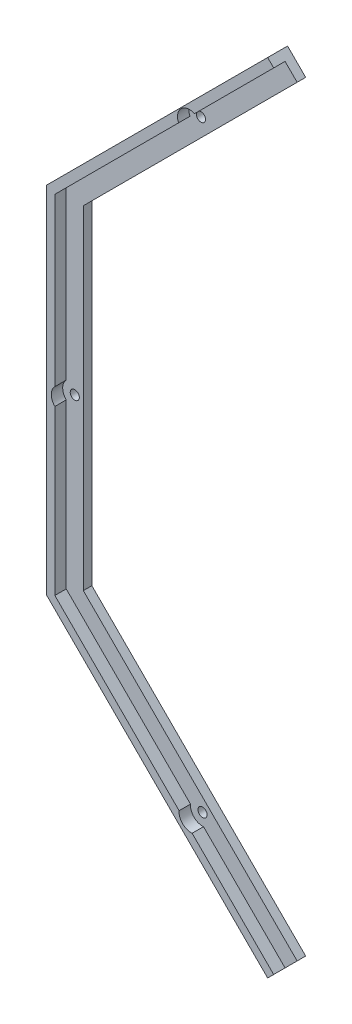
ISO-10303-21;
HEADER;
FILE_DESCRIPTION(('STEP AP214'),'2;1');
FILE_NAME('part.step','',(''),(''),'','','');
FILE_SCHEMA(('AUTOMOTIVE_DESIGN { 1 0 10303 214 1 1 1 1 }'));
ENDSEC;
DATA;
#1=APPLICATION_CONTEXT('core data for automotive mechanical design processes');
#2=APPLICATION_PROTOCOL_DEFINITION('international standard','automotive_design',2000,#1);
#3=PRODUCT_CONTEXT('',#1,'mechanical');
#4=PRODUCT('Part','Part','',(#3));
#5=PRODUCT_RELATED_PRODUCT_CATEGORY('part','',(#4));
#6=PRODUCT_DEFINITION_FORMATION('','',#4);
#7=PRODUCT_DEFINITION_CONTEXT('part definition',#1,'design');
#8=PRODUCT_DEFINITION('design','',#6,#7);
#9=PRODUCT_DEFINITION_SHAPE('','',#8);
#10=(LENGTH_UNIT() NAMED_UNIT(*) SI_UNIT(.MILLI.,.METRE.));
#11=(NAMED_UNIT(*) PLANE_ANGLE_UNIT() SI_UNIT($,.RADIAN.));
#12=(NAMED_UNIT(*) SI_UNIT($,.STERADIAN.) SOLID_ANGLE_UNIT());
#13=UNCERTAINTY_MEASURE_WITH_UNIT(LENGTH_MEASURE(1.E-05),#10,'distance_accuracy_value','');
#14=(GEOMETRIC_REPRESENTATION_CONTEXT(3) GLOBAL_UNCERTAINTY_ASSIGNED_CONTEXT((#13)) GLOBAL_UNIT_ASSIGNED_CONTEXT((#10,
#11,#12)) REPRESENTATION_CONTEXT('',''));
#15=CARTESIAN_POINT('',(0.,0.,0.));
#16=DIRECTION('',(0.,0.,1.));
#17=DIRECTION('',(1.,0.,0.));
#18=AXIS2_PLACEMENT_3D('',#15,#16,#17);
#19=CARTESIAN_POINT('',(-150.92388155424,61.0502525316989,10.));
#20=DIRECTION('',(-0.707106781186548,0.707106781186547,0.));
#21=DIRECTION('',(-0.707106781186547,-0.707106781186548,0.));
#22=AXIS2_PLACEMENT_3D('',#19,#20,#21);
#23=PLANE('',#22);
#24=DIRECTION('',(0.,0.,-1.));
#25=VECTOR('',#24,1.);
#26=CARTESIAN_POINT('',(-101.826733435737,110.147400650202,10.));
#27=LINE('',#26,#25);
#28=CARTESIAN_POINT('',(-101.826733435737,110.147400650202,6.));
#29=VERTEX_POINT('',#28);
#30=CARTESIAN_POINT('',(-101.826733435737,110.147400650202,10.));
#31=VERTEX_POINT('',#30);
#32=EDGE_CURVE('E60',#29,#31,#27,.F.);
#33=ORIENTED_EDGE('',*,*,#32,.F.);
#34=DIRECTION('',(0.707106781186547,0.707106781186548,0.));
#35=VECTOR('',#34,1.);
#36=CARTESIAN_POINT('',(-150.92388155424,61.0502525316989,6.));
#37=LINE('',#36,#35);
#38=CARTESIAN_POINT('',(-74.0208152801602,137.953318805779,6.));
#39=VERTEX_POINT('',#38);
#40=EDGE_CURVE('E11',#29,#39,#37,.T.);
#41=ORIENTED_EDGE('',*,*,#40,.T.);
#42=DIRECTION('',(0.,0.,-1.));
#43=VECTOR('',#42,1.);
#44=CARTESIAN_POINT('',(-74.0208152801602,137.953318805779,10.));
#45=LINE('',#44,#43);
#46=CARTESIAN_POINT('',(-74.0208152801602,137.953318805779,10.));
#47=VERTEX_POINT('',#46);
#48=EDGE_CURVE('E210',#47,#39,#45,.T.);
#49=ORIENTED_EDGE('',*,*,#48,.F.);
#50=DIRECTION('',(0.707106781186547,0.707106781186548,0.));
#51=VECTOR('',#50,1.);
#52=CARTESIAN_POINT('',(-150.92388155424,61.0502525316989,10.));
#53=LINE('',#52,#51);
#54=EDGE_CURVE('E202',#31,#47,#53,.T.);
#55=ORIENTED_EDGE('',*,*,#54,.F.);
#56=EDGE_LOOP('',(#33,#41,#49,#55));
#57=FACE_BOUND('',#56,.T.);
#58=ADVANCED_FACE('F35',(#57),#23,.F.);
#59=DIRECTION('',(0.,0.,-1.));
#60=VECTOR('',#59,1.);
#61=CARTESIAN_POINT('',(-107.450344375338,104.523789710601,10.));
#62=LINE('',#61,#60);
#63=CARTESIAN_POINT('',(-107.450344375338,104.523789710601,10.));
#64=VERTEX_POINT('',#63);
#65=CARTESIAN_POINT('',(-107.450344375338,104.523789710601,6.));
#66=VERTEX_POINT('',#65);
#67=EDGE_CURVE('E339',#64,#66,#62,.T.);
#68=ORIENTED_EDGE('',*,*,#67,.F.);
#69=CARTESIAN_POINT('',(-150.92388155424,61.0502525316989,10.));
#70=VERTEX_POINT('',#69);
#71=EDGE_CURVE('E325',#70,#64,#53,.T.);
#72=ORIENTED_EDGE('',*,*,#71,.F.);
#73=DIRECTION('',(0.,0.,-1.));
#74=VECTOR('',#73,1.);
#75=CARTESIAN_POINT('',(-150.92388155424,61.0502525316989,10.));
#76=LINE('',#75,#74);
#77=CARTESIAN_POINT('',(-150.92388155424,61.0502525316989,6.));
#78=VERTEX_POINT('',#77);
#79=EDGE_CURVE('E192',#70,#78,#76,.T.);
#80=ORIENTED_EDGE('',*,*,#79,.T.);
#81=EDGE_CURVE('E45',#78,#66,#37,.T.);
#82=ORIENTED_EDGE('',*,*,#81,.T.);
#83=EDGE_LOOP('',(#68,#72,#80,#82));
#84=FACE_BOUND('',#83,.T.);
#85=ADVANCED_FACE('F350',(#84),#23,.F.);
#86=CARTESIAN_POINT('',(-74.0208152801602,-137.953318805781,10.));
#87=DIRECTION('',(-0.707106781186547,-0.707106781186547,0.));
#88=DIRECTION('',(0.707106781186548,-0.707106781186548,0.));
#89=AXIS2_PLACEMENT_3D('',#86,#87,#88);
#90=PLANE('',#89);
#91=DIRECTION('',(0.,0.,-1.));
#92=VECTOR('',#91,1.);
#93=CARTESIAN_POINT('',(-107.263636264678,-104.710497821264,10.));
#94=LINE('',#93,#92);
#95=CARTESIAN_POINT('',(-107.263636264678,-104.710497821264,6.));
#96=VERTEX_POINT('',#95);
#97=CARTESIAN_POINT('',(-107.263636264678,-104.710497821264,10.));
#98=VERTEX_POINT('',#97);
#99=EDGE_CURVE('E52',#96,#98,#94,.F.);
#100=ORIENTED_EDGE('',*,*,#99,.F.);
#101=DIRECTION('',(-0.707106781186547,0.707106781186547,0.));
#102=VECTOR('',#101,1.);
#103=CARTESIAN_POINT('',(-74.0208152801602,-137.953318805781,6.));
#104=LINE('',#103,#102);
#105=CARTESIAN_POINT('',(-150.92388155424,-61.0502525317016,6.));
#106=VERTEX_POINT('',#105);
#107=EDGE_CURVE('E195',#96,#106,#104,.T.);
#108=ORIENTED_EDGE('',*,*,#107,.T.);
#109=DIRECTION('',(0.,0.,-1.));
#110=VECTOR('',#109,1.);
#111=CARTESIAN_POINT('',(-150.92388155424,-61.0502525317016,10.));
#112=LINE('',#111,#110);
#113=CARTESIAN_POINT('',(-150.92388155424,-61.0502525317016,10.));
#114=VERTEX_POINT('',#113);
#115=EDGE_CURVE('E205',#114,#106,#112,.T.);
#116=ORIENTED_EDGE('',*,*,#115,.F.);
#117=DIRECTION('',(-0.707106781186547,0.707106781186547,0.));
#118=VECTOR('',#117,1.);
#119=CARTESIAN_POINT('',(-74.0208152801602,-137.953318805781,10.));
#120=LINE('',#119,#118);
#121=EDGE_CURVE('E185',#98,#114,#120,.T.);
#122=ORIENTED_EDGE('',*,*,#121,.F.);
#123=EDGE_LOOP('',(#100,#108,#116,#122));
#124=FACE_BOUND('',#123,.T.);
#125=ADVANCED_FACE('F368',(#124),#90,.F.);
#126=DIRECTION('',(0.,0.,-1.));
#127=VECTOR('',#126,1.);
#128=CARTESIAN_POINT('',(-102.681060569722,-109.293073516219,10.));
#129=LINE('',#128,#127);
#130=CARTESIAN_POINT('',(-102.681060569722,-109.293073516219,10.));
#131=VERTEX_POINT('',#130);
#132=CARTESIAN_POINT('',(-102.681060569722,-109.293073516219,6.));
#133=VERTEX_POINT('',#132);
#134=EDGE_CURVE('E161',#131,#133,#129,.T.);
#135=ORIENTED_EDGE('',*,*,#134,.F.);
#136=CARTESIAN_POINT('',(-74.0208152801602,-137.953318805781,10.));
#137=VERTEX_POINT('',#136);
#138=EDGE_CURVE('E174',#137,#131,#120,.T.);
#139=ORIENTED_EDGE('',*,*,#138,.F.);
#140=DIRECTION('',(0.,0.,-1.));
#141=VECTOR('',#140,1.);
#142=CARTESIAN_POINT('',(-74.0208152801602,-137.953318805781,10.));
#143=LINE('',#142,#141);
#144=CARTESIAN_POINT('',(-74.0208152801602,-137.953318805781,6.));
#145=VERTEX_POINT('',#144);
#146=EDGE_CURVE('E208',#137,#145,#143,.T.);
#147=ORIENTED_EDGE('',*,*,#146,.T.);
#148=EDGE_CURVE('E175',#145,#133,#104,.T.);
#149=ORIENTED_EDGE('',*,*,#148,.T.);
#150=EDGE_LOOP('',(#135,#139,#147,#149));
#151=FACE_BOUND('',#150,.T.);
#152=ADVANCED_FACE('F172',(#151),#90,.F.);
#153=CARTESIAN_POINT('',(-150.92388155424,-61.0502525317016,10.));
#154=DIRECTION('',(-1.,0.,0.));
#155=DIRECTION('',(0.,0.,1.));
#156=AXIS2_PLACEMENT_3D('',#153,#154,#155);
#157=PLANE('',#156);
#158=DIRECTION('',(0.,0.,-1.));
#159=VECTOR('',#158,1.);
#160=CARTESIAN_POINT('',(-150.92388155424,2.51039864469681,10.));
#161=LINE('',#160,#159);
#162=CARTESIAN_POINT('',(-150.92388155424,2.51039864469681,6.));
#163=VERTEX_POINT('',#162);
#164=CARTESIAN_POINT('',(-150.92388155424,2.51039864469681,10.));
#165=VERTEX_POINT('',#164);
#166=EDGE_CURVE('E329',#163,#165,#161,.F.);
#167=ORIENTED_EDGE('',*,*,#166,.F.);
#168=DIRECTION('',(0.,1.,0.));
#169=VECTOR('',#168,1.);
#170=CARTESIAN_POINT('',(-150.92388155424,-61.0502525317016,6.));
#171=LINE('',#170,#169);
#172=EDGE_CURVE('E198',#163,#78,#171,.T.);
#173=ORIENTED_EDGE('',*,*,#172,.T.);
#174=ORIENTED_EDGE('',*,*,#79,.F.);
#175=DIRECTION('',(0.,1.,0.));
#176=VECTOR('',#175,1.);
#177=CARTESIAN_POINT('',(-150.92388155424,-61.0502525317016,10.));
#178=LINE('',#177,#176);
#179=EDGE_CURVE('E184',#165,#70,#178,.T.);
#180=ORIENTED_EDGE('',*,*,#179,.F.);
#181=EDGE_LOOP('',(#167,#173,#174,#180));
#182=FACE_BOUND('',#181,.T.);
#183=ADVANCED_FACE('F357',(#182),#157,.F.);
#184=DIRECTION('',(0.,0.,-1.));
#185=VECTOR('',#184,1.);
#186=CARTESIAN_POINT('',(-150.92388155424,-3.5103986446994,10.));
#187=LINE('',#186,#185);
#188=CARTESIAN_POINT('',(-150.92388155424,-3.5103986446994,10.));
#189=VERTEX_POINT('',#188);
#190=CARTESIAN_POINT('',(-150.92388155424,-3.5103986446994,6.));
#191=VERTEX_POINT('',#190);
#192=EDGE_CURVE('E331',#189,#191,#187,.T.);
#193=ORIENTED_EDGE('',*,*,#192,.F.);
#194=EDGE_CURVE('E187',#114,#189,#178,.T.);
#195=ORIENTED_EDGE('',*,*,#194,.F.);
#196=ORIENTED_EDGE('',*,*,#115,.T.);
#197=EDGE_CURVE('E199',#106,#191,#171,.T.);
#198=ORIENTED_EDGE('',*,*,#197,.T.);
#199=EDGE_LOOP('',(#193,#195,#196,#198));
#200=FACE_BOUND('',#199,.T.);
#201=ADVANCED_FACE('F373',(#200),#157,.F.);
#202=CARTESIAN_POINT('',(0.,0.,6.));
#203=DIRECTION('',(0.,0.,-1.));
#204=DIRECTION('',(-1.,0.,0.));
#205=AXIS2_PLACEMENT_3D('',#202,#203,#204);
#206=PLANE('',#205);
#207=ORIENTED_EDGE('',*,*,#40,.F.);
#208=CARTESIAN_POINT('',(-103.577878733758,106.274935008621,6.));
#209=DIRECTION('',(0.,0.,1.));
#210=DIRECTION('',(1.,0.,0.));
#211=AXIS2_PLACEMENT_3D('',#208,#209,#210);
#212=CIRCLE('',#211,4.25000000000001);
#213=EDGE_CURVE('E166',#29,#66,#212,.T.);
#214=ORIENTED_EDGE('',*,*,#213,.T.);
#215=ORIENTED_EDGE('',*,*,#81,.F.);
#216=ORIENTED_EDGE('',*,*,#172,.F.);
#217=CARTESIAN_POINT('',(-147.92388155424,-0.500000000001298,6.));
#218=DIRECTION('',(0.,0.,1.));
#219=DIRECTION('',(1.,0.,0.));
#220=AXIS2_PLACEMENT_3D('',#217,#218,#219);
#221=CIRCLE('',#220,4.25000000000001);
#222=EDGE_CURVE('E334',#163,#191,#221,.T.);
#223=ORIENTED_EDGE('',*,*,#222,.T.);
#224=ORIENTED_EDGE('',*,*,#197,.F.);
#225=ORIENTED_EDGE('',*,*,#107,.F.);
#226=CARTESIAN_POINT('',(-103.027804768937,-105.057242020478,6.));
#227=DIRECTION('',(0.,0.,1.));
#228=DIRECTION('',(1.,0.,0.));
#229=AXIS2_PLACEMENT_3D('',#226,#227,#228);
#230=CIRCLE('',#229,4.25000000000001);
#231=EDGE_CURVE('E167',#96,#133,#230,.T.);
#232=ORIENTED_EDGE('',*,*,#231,.T.);
#233=ORIENTED_EDGE('',*,*,#148,.F.);
#234=DIRECTION('',(0.707106781186546,0.707106781186549,0.));
#235=VECTOR('',#234,1.);
#236=CARTESIAN_POINT('',(-69.7781745930409,-133.710678118662,6.));
#237=LINE('',#236,#235);
#238=CARTESIAN_POINT('',(-69.7781745930409,-133.710678118662,6.));
#239=VERTEX_POINT('',#238);
#240=EDGE_CURVE('E229',#145,#239,#237,.T.);
#241=ORIENTED_EDGE('',*,*,#240,.T.);
#242=DIRECTION('',(-0.707106781186548,0.707106781186547,0.));
#243=VECTOR('',#242,1.);
#244=CARTESIAN_POINT('',(-144.92388155424,-58.564971157463,6.));
#245=LINE('',#244,#243);
#246=CARTESIAN_POINT('',(-144.92388155424,-58.564971157463,6.));
#247=VERTEX_POINT('',#246);
#248=EDGE_CURVE('E231',#239,#247,#245,.T.);
#249=ORIENTED_EDGE('',*,*,#248,.T.);
#250=DIRECTION('',(0.,1.,0.));
#251=VECTOR('',#250,1.);
#252=CARTESIAN_POINT('',(-144.92388155424,58.5649711574602,6.));
#253=LINE('',#252,#251);
#254=CARTESIAN_POINT('',(-144.92388155424,58.5649711574602,6.));
#255=VERTEX_POINT('',#254);
#256=EDGE_CURVE('E234',#247,#255,#253,.T.);
#257=ORIENTED_EDGE('',*,*,#256,.T.);
#258=DIRECTION('',(0.707106781186547,0.707106781186548,0.));
#259=VECTOR('',#258,1.);
#260=CARTESIAN_POINT('',(-69.7781745930409,133.71067811866,6.));
#261=LINE('',#260,#259);
#262=CARTESIAN_POINT('',(-69.7781745930409,133.71067811866,6.));
#263=VERTEX_POINT('',#262);
#264=EDGE_CURVE('E236',#255,#263,#261,.T.);
#265=ORIENTED_EDGE('',*,*,#264,.T.);
#266=DIRECTION('',(-0.707106781186548,0.707106781186547,0.));
#267=VECTOR('',#266,1.);
#268=CARTESIAN_POINT('',(-76.1421356237198,140.074639149338,6.));
#269=LINE('',#268,#267);
#270=EDGE_CURVE('E238',#263,#39,#269,.T.);
#271=ORIENTED_EDGE('',*,*,#270,.T.);
#272=EDGE_LOOP('',(#207,#214,#215,#216,#223,#224,#225,#232,#233,#241,#249,#257,#265,#271));
#273=FACE_BOUND('',#272,.T.);
#274=CARTESIAN_POINT('',(-147.92388155424,-0.500000000001298,6.));
#275=DIRECTION('',(0.,0.,1.));
#276=DIRECTION('',(1.,0.,0.));
#277=AXIS2_PLACEMENT_3D('',#274,#275,#276);
#278=CIRCLE('',#277,1.59999999999999);
#279=CARTESIAN_POINT('',(-146.32388155424,-0.500000000001298,6.));
#280=VERTEX_POINT('',#279);
#281=EDGE_CURVE('E223',#280,#280,#278,.T.);
#282=ORIENTED_EDGE('',*,*,#281,.F.);
#283=EDGE_LOOP('',(#282));
#284=FACE_BOUND('',#283,.T.);
#285=CARTESIAN_POINT('',(-103.027804768937,-105.057242020478,6.));
#286=DIRECTION('',(0.,0.,1.));
#287=DIRECTION('',(1.,0.,0.));
#288=AXIS2_PLACEMENT_3D('',#285,#286,#287);
#289=CIRCLE('',#288,1.60000000000001);
#290=CARTESIAN_POINT('',(-101.427804768937,-105.057242020478,6.));
#291=VERTEX_POINT('',#290);
#292=EDGE_CURVE('E220',#291,#291,#289,.T.);
#293=ORIENTED_EDGE('',*,*,#292,.F.);
#294=EDGE_LOOP('',(#293));
#295=FACE_BOUND('',#294,.T.);
#296=CARTESIAN_POINT('',(-103.577878733758,106.274935008621,6.));
#297=DIRECTION('',(0.,0.,1.));
#298=DIRECTION('',(1.,0.,0.));
#299=AXIS2_PLACEMENT_3D('',#296,#297,#298);
#300=CIRCLE('',#299,1.60000000000001);
#301=CARTESIAN_POINT('',(-101.977878733758,106.274935008621,6.));
#302=VERTEX_POINT('',#301);
#303=EDGE_CURVE('E214',#302,#302,#300,.T.);
#304=ORIENTED_EDGE('',*,*,#303,.F.);
#305=EDGE_LOOP('',(#304));
#306=FACE_BOUND('',#305,.T.);
#307=ADVANCED_FACE('F361',(#273,#284,#295,#306),#206,.F.);
#308=CARTESIAN_POINT('',(-103.577878733758,106.274935008621,6.));
#309=DIRECTION('',(0.,0.,-1.));
#310=DIRECTION('',(-1.,0.,0.));
#311=AXIS2_PLACEMENT_3D('',#308,#309,#310);
#312=CYLINDRICAL_SURFACE('',#311,1.60000000000001);
#313=ORIENTED_EDGE('',*,*,#303,.T.);
#314=EDGE_LOOP('',(#313));
#315=FACE_BOUND('',#314,.T.);
#316=CARTESIAN_POINT('',(-103.577878733758,106.274935008621,3.));
#317=DIRECTION('',(0.,0.,1.));
#318=DIRECTION('',(1.,0.,0.));
#319=AXIS2_PLACEMENT_3D('',#316,#317,#318);
#320=CIRCLE('',#319,1.60000000000001);
#321=CARTESIAN_POINT('',(-101.977878733758,106.274935008621,3.));
#322=VERTEX_POINT('',#321);
#323=EDGE_CURVE('E213',#322,#322,#320,.T.);
#324=ORIENTED_EDGE('',*,*,#323,.F.);
#325=EDGE_LOOP('',(#324));
#326=FACE_BOUND('',#325,.T.);
#327=ADVANCED_FACE('F394',(#315,#326),#312,.F.);
#328=CARTESIAN_POINT('',(-103.027804768937,-105.057242020478,6.));
#329=DIRECTION('',(0.,0.,-1.));
#330=DIRECTION('',(-1.,0.,0.));
#331=AXIS2_PLACEMENT_3D('',#328,#329,#330);
#332=CYLINDRICAL_SURFACE('',#331,1.60000000000001);
#333=ORIENTED_EDGE('',*,*,#292,.T.);
#334=EDGE_LOOP('',(#333));
#335=FACE_BOUND('',#334,.T.);
#336=CARTESIAN_POINT('',(-103.027804768937,-105.057242020478,3.));
#337=DIRECTION('',(0.,0.,1.));
#338=DIRECTION('',(1.,0.,0.));
#339=AXIS2_PLACEMENT_3D('',#336,#337,#338);
#340=CIRCLE('',#339,1.60000000000001);
#341=CARTESIAN_POINT('',(-101.427804768937,-105.057242020478,3.));
#342=VERTEX_POINT('',#341);
#343=EDGE_CURVE('E217',#342,#342,#340,.T.);
#344=ORIENTED_EDGE('',*,*,#343,.F.);
#345=EDGE_LOOP('',(#344));
#346=FACE_BOUND('',#345,.T.);
#347=ADVANCED_FACE('F397',(#335,#346),#332,.F.);
#348=CARTESIAN_POINT('',(-147.92388155424,-0.500000000001298,6.));
#349=DIRECTION('',(0.,0.,-1.));
#350=DIRECTION('',(-1.,0.,0.));
#351=AXIS2_PLACEMENT_3D('',#348,#349,#350);
#352=CYLINDRICAL_SURFACE('',#351,1.59999999999999);
#353=ORIENTED_EDGE('',*,*,#281,.T.);
#354=EDGE_LOOP('',(#353));
#355=FACE_BOUND('',#354,.T.);
#356=CARTESIAN_POINT('',(-147.92388155424,-0.500000000001298,3.));
#357=DIRECTION('',(0.,0.,1.));
#358=DIRECTION('',(1.,0.,0.));
#359=AXIS2_PLACEMENT_3D('',#356,#357,#358);
#360=CIRCLE('',#359,1.59999999999999);
#361=CARTESIAN_POINT('',(-146.32388155424,-0.500000000001298,3.));
#362=VERTEX_POINT('',#361);
#363=EDGE_CURVE('E196',#362,#362,#360,.T.);
#364=ORIENTED_EDGE('',*,*,#363,.F.);
#365=EDGE_LOOP('',(#364));
#366=FACE_BOUND('',#365,.T.);
#367=ADVANCED_FACE('F401',(#355,#366),#352,.F.);
#368=CARTESIAN_POINT('',(-76.1421356237198,140.074639149338,6.));
#369=DIRECTION('',(-0.707106781186547,-0.707106781186548,0.));
#370=DIRECTION('',(0.707106781186548,-0.707106781186547,0.));
#371=AXIS2_PLACEMENT_3D('',#368,#369,#370);
#372=PLANE('',#371);
#373=DIRECTION('',(-0.707106781186548,0.707106781186547,0.));
#374=VECTOR('',#373,1.);
#375=CARTESIAN_POINT('',(-76.1421356237198,140.074639149338,3.));
#376=LINE('',#375,#374);
#377=CARTESIAN_POINT('',(-69.7781745930409,133.71067811866,3.));
#378=VERTEX_POINT('',#377);
#379=CARTESIAN_POINT('',(-76.1421356237198,140.074639149338,3.));
#380=VERTEX_POINT('',#379);
#381=EDGE_CURVE('E232',#378,#380,#376,.T.);
#382=ORIENTED_EDGE('',*,*,#381,.T.);
#383=DIRECTION('',(0.,0.,-1.));
#384=VECTOR('',#383,1.);
#385=CARTESIAN_POINT('',(-76.1421356237198,140.074639149338,6.));
#386=LINE('',#385,#384);
#387=CARTESIAN_POINT('',(-76.1421356237198,140.074639149338,10.));
#388=VERTEX_POINT('',#387);
#389=EDGE_CURVE('E241',#388,#380,#386,.T.);
#390=ORIENTED_EDGE('',*,*,#389,.F.);
#391=DIRECTION('',(-0.707106781186547,0.707106781186547,0.));
#392=VECTOR('',#391,1.);
#393=CARTESIAN_POINT('',(-74.0208152801602,137.953318805779,10.));
#394=LINE('',#393,#392);
#395=EDGE_CURVE('E323',#47,#388,#394,.T.);
#396=ORIENTED_EDGE('',*,*,#395,.F.);
#397=ORIENTED_EDGE('',*,*,#48,.T.);
#398=ORIENTED_EDGE('',*,*,#270,.F.);
#399=DIRECTION('',(0.,0.,-1.));
#400=VECTOR('',#399,1.);
#401=CARTESIAN_POINT('',(-69.7781745930409,133.71067811866,6.));
#402=LINE('',#401,#400);
#403=EDGE_CURVE('E266',#263,#378,#402,.T.);
#404=ORIENTED_EDGE('',*,*,#403,.T.);
#405=EDGE_LOOP('',(#382,#390,#396,#397,#398,#404));
#406=FACE_BOUND('',#405,.T.);
#407=ADVANCED_FACE('F297',(#406),#372,.F.);
#408=CARTESIAN_POINT('',(-69.7781745930409,133.71067811866,6.));
#409=DIRECTION('',(-0.707106781186548,0.707106781186547,0.));
#410=DIRECTION('',(-0.707106781186547,-0.707106781186548,0.));
#411=AXIS2_PLACEMENT_3D('',#408,#409,#410);
#412=PLANE('',#411);
#413=DIRECTION('',(0.707106781186547,0.707106781186548,0.));
#414=VECTOR('',#413,1.);
#415=CARTESIAN_POINT('',(-69.7781745930409,133.71067811866,3.));
#416=LINE('',#415,#414);
#417=CARTESIAN_POINT('',(-144.92388155424,58.5649711574602,3.));
#418=VERTEX_POINT('',#417);
#419=EDGE_CURVE('E259',#418,#378,#416,.T.);
#420=ORIENTED_EDGE('',*,*,#419,.T.);
#421=ORIENTED_EDGE('',*,*,#403,.F.);
#422=ORIENTED_EDGE('',*,*,#264,.F.);
#423=DIRECTION('',(0.,0.,-1.));
#424=VECTOR('',#423,1.);
#425=CARTESIAN_POINT('',(-144.92388155424,58.5649711574602,6.));
#426=LINE('',#425,#424);
#427=EDGE_CURVE('E269',#255,#418,#426,.T.);
#428=ORIENTED_EDGE('',*,*,#427,.T.);
#429=EDGE_LOOP('',(#420,#421,#422,#428));
#430=FACE_BOUND('',#429,.T.);
#431=ADVANCED_FACE('F304',(#430),#412,.F.);
#432=CARTESIAN_POINT('',(-144.92388155424,58.5649711574602,6.));
#433=DIRECTION('',(-1.,0.,0.));
#434=DIRECTION('',(0.,-1.,0.));
#435=AXIS2_PLACEMENT_3D('',#432,#433,#434);
#436=PLANE('',#435);
#437=DIRECTION('',(0.,1.,0.));
#438=VECTOR('',#437,1.);
#439=CARTESIAN_POINT('',(-144.92388155424,58.5649711574602,3.));
#440=LINE('',#439,#438);
#441=CARTESIAN_POINT('',(-144.92388155424,-58.564971157463,3.));
#442=VERTEX_POINT('',#441);
#443=EDGE_CURVE('E256',#442,#418,#440,.T.);
#444=ORIENTED_EDGE('',*,*,#443,.T.);
#445=ORIENTED_EDGE('',*,*,#427,.F.);
#446=ORIENTED_EDGE('',*,*,#256,.F.);
#447=DIRECTION('',(0.,0.,-1.));
#448=VECTOR('',#447,1.);
#449=CARTESIAN_POINT('',(-144.92388155424,-58.564971157463,6.));
#450=LINE('',#449,#448);
#451=EDGE_CURVE('E272',#247,#442,#450,.T.);
#452=ORIENTED_EDGE('',*,*,#451,.T.);
#453=EDGE_LOOP('',(#444,#445,#446,#452));
#454=FACE_BOUND('',#453,.T.);
#455=ADVANCED_FACE('F307',(#454),#436,.F.);
#456=CARTESIAN_POINT('',(-144.92388155424,-58.564971157463,6.));
#457=DIRECTION('',(-0.707106781186547,-0.707106781186548,0.));
#458=DIRECTION('',(0.707106781186548,-0.707106781186547,0.));
#459=AXIS2_PLACEMENT_3D('',#456,#457,#458);
#460=PLANE('',#459);
#461=DIRECTION('',(-0.707106781186548,0.707106781186547,0.));
#462=VECTOR('',#461,1.);
#463=CARTESIAN_POINT('',(-144.92388155424,-58.564971157463,3.));
#464=LINE('',#463,#462);
#465=CARTESIAN_POINT('',(-69.7781745930409,-133.710678118662,3.));
#466=VERTEX_POINT('',#465);
#467=EDGE_CURVE('E253',#466,#442,#464,.T.);
#468=ORIENTED_EDGE('',*,*,#467,.T.);
#469=ORIENTED_EDGE('',*,*,#451,.F.);
#470=ORIENTED_EDGE('',*,*,#248,.F.);
#471=DIRECTION('',(0.,0.,-1.));
#472=VECTOR('',#471,1.);
#473=CARTESIAN_POINT('',(-69.7781745930409,-133.710678118662,6.));
#474=LINE('',#473,#472);
#475=EDGE_CURVE('E275',#239,#466,#474,.T.);
#476=ORIENTED_EDGE('',*,*,#475,.T.);
#477=EDGE_LOOP('',(#468,#469,#470,#476));
#478=FACE_BOUND('',#477,.T.);
#479=ADVANCED_FACE('F312',(#478),#460,.F.);
#480=CARTESIAN_POINT('',(-69.7781745930409,-133.710678118662,6.));
#481=DIRECTION('',(-0.707106781186549,0.707106781186546,0.));
#482=DIRECTION('',(-0.707106781186546,-0.707106781186549,0.));
#483=AXIS2_PLACEMENT_3D('',#480,#481,#482);
#484=PLANE('',#483);
#485=DIRECTION('',(0.707106781186546,0.707106781186549,0.));
#486=VECTOR('',#485,1.);
#487=CARTESIAN_POINT('',(-69.7781745930409,-133.710678118662,3.));
#488=LINE('',#487,#486);
#489=CARTESIAN_POINT('',(-76.1421356237198,-140.074639149341,3.));
#490=VERTEX_POINT('',#489);
#491=EDGE_CURVE('E250',#490,#466,#488,.T.);
#492=ORIENTED_EDGE('',*,*,#491,.T.);
#493=ORIENTED_EDGE('',*,*,#475,.F.);
#494=ORIENTED_EDGE('',*,*,#240,.F.);
#495=ORIENTED_EDGE('',*,*,#146,.F.);
#496=DIRECTION('',(0.707106781186543,0.707106781186552,0.));
#497=VECTOR('',#496,1.);
#498=CARTESIAN_POINT('',(-76.1421356237198,-140.074639149341,10.));
#499=LINE('',#498,#497);
#500=CARTESIAN_POINT('',(-76.1421356237198,-140.074639149341,10.));
#501=VERTEX_POINT('',#500);
#502=EDGE_CURVE('E182',#501,#137,#499,.T.);
#503=ORIENTED_EDGE('',*,*,#502,.F.);
#504=DIRECTION('',(0.,0.,-1.));
#505=VECTOR('',#504,1.);
#506=CARTESIAN_POINT('',(-76.1421356237198,-140.074639149341,6.));
#507=LINE('',#506,#505);
#508=EDGE_CURVE('E278',#501,#490,#507,.T.);
#509=ORIENTED_EDGE('',*,*,#508,.T.);
#510=EDGE_LOOP('',(#492,#493,#494,#495,#503,#509));
#511=FACE_BOUND('',#510,.T.);
#512=ADVANCED_FACE('F315',(#511),#484,.F.);
#513=CARTESIAN_POINT('',(-76.1421356237198,-140.074639149341,6.));
#514=DIRECTION('',(0.707106781186547,0.707106781186548,0.));
#515=DIRECTION('',(-0.707106781186548,0.707106781186547,0.));
#516=AXIS2_PLACEMENT_3D('',#513,#514,#515);
#517=PLANE('',#516);
#518=DIRECTION('',(0.707106781186548,-0.707106781186547,0.));
#519=VECTOR('',#518,1.);
#520=CARTESIAN_POINT('',(-76.1421356237198,-140.074639149341,3.));
#521=LINE('',#520,#519);
#522=CARTESIAN_POINT('',(-153.92388155424,-62.2928932188208,3.));
#523=VERTEX_POINT('',#522);
#524=EDGE_CURVE('E247',#523,#490,#521,.T.);
#525=ORIENTED_EDGE('',*,*,#524,.T.);
#526=ORIENTED_EDGE('',*,*,#508,.F.);
#527=DIRECTION('',(0.707106781186548,-0.707106781186547,0.));
#528=VECTOR('',#527,1.);
#529=CARTESIAN_POINT('',(-153.92388155424,-62.2928932188208,10.));
#530=LINE('',#529,#528);
#531=CARTESIAN_POINT('',(-153.92388155424,-62.2928932188208,10.));
#532=VERTEX_POINT('',#531);
#533=EDGE_CURVE('E318',#532,#501,#530,.T.);
#534=ORIENTED_EDGE('',*,*,#533,.F.);
#535=DIRECTION('',(0.,0.,-1.));
#536=VECTOR('',#535,1.);
#537=CARTESIAN_POINT('',(-153.92388155424,-62.2928932188208,6.));
#538=LINE('',#537,#536);
#539=EDGE_CURVE('E280',#532,#523,#538,.T.);
#540=ORIENTED_EDGE('',*,*,#539,.T.);
#541=EDGE_LOOP('',(#525,#526,#534,#540));
#542=FACE_BOUND('',#541,.T.);
#543=ADVANCED_FACE('F317',(#542),#517,.F.);
#544=CARTESIAN_POINT('',(-153.92388155424,-62.2928932188208,6.));
#545=DIRECTION('',(1.,0.,0.));
#546=DIRECTION('',(0.,0.,-1.));
#547=AXIS2_PLACEMENT_3D('',#544,#545,#546);
#548=PLANE('',#547);
#549=DIRECTION('',(0.,-1.,0.));
#550=VECTOR('',#549,1.);
#551=CARTESIAN_POINT('',(-153.92388155424,-62.2928932188208,3.));
#552=LINE('',#551,#550);
#553=CARTESIAN_POINT('',(-153.92388155424,62.2928932188182,3.));
#554=VERTEX_POINT('',#553);
#555=EDGE_CURVE('E244',#554,#523,#552,.T.);
#556=ORIENTED_EDGE('',*,*,#555,.T.);
#557=ORIENTED_EDGE('',*,*,#539,.F.);
#558=DIRECTION('',(0.,-1.,0.));
#559=VECTOR('',#558,1.);
#560=CARTESIAN_POINT('',(-153.92388155424,62.2928932188182,10.));
#561=LINE('',#560,#559);
#562=CARTESIAN_POINT('',(-153.92388155424,62.2928932188182,10.));
#563=VERTEX_POINT('',#562);
#564=EDGE_CURVE('E289',#563,#532,#561,.T.);
#565=ORIENTED_EDGE('',*,*,#564,.F.);
#566=DIRECTION('',(0.,0.,-1.));
#567=VECTOR('',#566,1.);
#568=CARTESIAN_POINT('',(-153.92388155424,62.2928932188182,6.));
#569=LINE('',#568,#567);
#570=EDGE_CURVE('E39',#563,#554,#569,.T.);
#571=ORIENTED_EDGE('',*,*,#570,.T.);
#572=EDGE_LOOP('',(#556,#557,#565,#571));
#573=FACE_BOUND('',#572,.T.);
#574=ADVANCED_FACE('F287',(#573),#548,.F.);
#575=CARTESIAN_POINT('',(-153.92388155424,62.2928932188182,6.));
#576=DIRECTION('',(0.707106781186548,-0.707106781186547,0.));
#577=DIRECTION('',(0.707106781186547,0.707106781186548,0.));
#578=AXIS2_PLACEMENT_3D('',#575,#576,#577);
#579=PLANE('',#578);
#580=DIRECTION('',(-0.707106781186547,-0.707106781186548,0.));
#581=VECTOR('',#580,1.);
#582=CARTESIAN_POINT('',(-153.92388155424,62.2928932188182,3.));
#583=LINE('',#582,#581);
#584=EDGE_CURVE('E228',#380,#554,#583,.T.);
#585=ORIENTED_EDGE('',*,*,#584,.T.);
#586=ORIENTED_EDGE('',*,*,#570,.F.);
#587=DIRECTION('',(-0.707106781186547,-0.707106781186548,0.));
#588=VECTOR('',#587,1.);
#589=CARTESIAN_POINT('',(-76.1421356237198,140.074639149338,10.));
#590=LINE('',#589,#588);
#591=EDGE_CURVE('E319',#388,#563,#590,.T.);
#592=ORIENTED_EDGE('',*,*,#591,.F.);
#593=ORIENTED_EDGE('',*,*,#389,.T.);
#594=EDGE_LOOP('',(#585,#586,#592,#593));
#595=FACE_BOUND('',#594,.T.);
#596=ADVANCED_FACE('F37',(#595),#579,.F.);
#597=CARTESIAN_POINT('',(0.,0.,10.));
#598=DIRECTION('',(0.,0.,1.));
#599=DIRECTION('',(1.,0.,0.));
#600=AXIS2_PLACEMENT_3D('',#597,#598,#599);
#601=PLANE('',#600);
#602=ORIENTED_EDGE('',*,*,#71,.T.);
#603=CARTESIAN_POINT('',(-103.577878733758,106.274935008621,10.));
#604=DIRECTION('',(0.,0.,1.));
#605=DIRECTION('',(1.,0.,0.));
#606=AXIS2_PLACEMENT_3D('',#603,#604,#605);
#607=CIRCLE('',#606,4.25000000000001);
#608=EDGE_CURVE('E176',#31,#64,#607,.T.);
#609=ORIENTED_EDGE('',*,*,#608,.F.);
#610=ORIENTED_EDGE('',*,*,#54,.T.);
#611=ORIENTED_EDGE('',*,*,#395,.T.);
#612=ORIENTED_EDGE('',*,*,#591,.T.);
#613=ORIENTED_EDGE('',*,*,#564,.T.);
#614=ORIENTED_EDGE('',*,*,#533,.T.);
#615=ORIENTED_EDGE('',*,*,#502,.T.);
#616=ORIENTED_EDGE('',*,*,#138,.T.);
#617=CARTESIAN_POINT('',(-103.027804768937,-105.057242020478,10.));
#618=DIRECTION('',(0.,0.,1.));
#619=DIRECTION('',(1.,0.,0.));
#620=AXIS2_PLACEMENT_3D('',#617,#618,#619);
#621=CIRCLE('',#620,4.25000000000001);
#622=EDGE_CURVE('E158',#98,#131,#621,.T.);
#623=ORIENTED_EDGE('',*,*,#622,.F.);
#624=ORIENTED_EDGE('',*,*,#121,.T.);
#625=ORIENTED_EDGE('',*,*,#194,.T.);
#626=CARTESIAN_POINT('',(-147.92388155424,-0.500000000001298,10.));
#627=DIRECTION('',(0.,0.,1.));
#628=DIRECTION('',(1.,0.,0.));
#629=AXIS2_PLACEMENT_3D('',#626,#627,#628);
#630=CIRCLE('',#629,4.25000000000001);
#631=EDGE_CURVE('E333',#165,#189,#630,.T.);
#632=ORIENTED_EDGE('',*,*,#631,.F.);
#633=ORIENTED_EDGE('',*,*,#179,.T.);
#634=EDGE_LOOP('',(#602,#609,#610,#611,#612,#613,#614,#615,#616,#623,#624,#625,#632,#633));
#635=FACE_BOUND('',#634,.T.);
#636=ADVANCED_FACE('F179',(#635),#601,.T.);
#637=CARTESIAN_POINT('',(0.,0.,3.));
#638=DIRECTION('',(0.,0.,-1.));
#639=DIRECTION('',(-1.,0.,0.));
#640=AXIS2_PLACEMENT_3D('',#637,#638,#639);
#641=PLANE('',#640);
#642=ORIENTED_EDGE('',*,*,#343,.T.);
#643=EDGE_LOOP('',(#642));
#644=FACE_BOUND('',#643,.T.);
#645=ORIENTED_EDGE('',*,*,#323,.T.);
#646=EDGE_LOOP('',(#645));
#647=FACE_BOUND('',#646,.T.);
#648=ORIENTED_EDGE('',*,*,#419,.F.);
#649=ORIENTED_EDGE('',*,*,#443,.F.);
#650=ORIENTED_EDGE('',*,*,#467,.F.);
#651=ORIENTED_EDGE('',*,*,#491,.F.);
#652=ORIENTED_EDGE('',*,*,#524,.F.);
#653=ORIENTED_EDGE('',*,*,#555,.F.);
#654=ORIENTED_EDGE('',*,*,#584,.F.);
#655=ORIENTED_EDGE('',*,*,#381,.F.);
#656=EDGE_LOOP('',(#648,#649,#650,#651,#652,#653,#654,#655));
#657=FACE_BOUND('',#656,.T.);
#658=ORIENTED_EDGE('',*,*,#363,.T.);
#659=EDGE_LOOP('',(#658));
#660=FACE_BOUND('',#659,.T.);
#661=ADVANCED_FACE('F294',(#644,#647,#657,#660),#641,.T.);
#662=CARTESIAN_POINT('',(-147.92388155424,-0.500000000001298,10.));
#663=DIRECTION('',(0.,0.,-1.));
#664=DIRECTION('',(-1.,0.,0.));
#665=AXIS2_PLACEMENT_3D('',#662,#663,#664);
#666=CYLINDRICAL_SURFACE('',#665,4.25000000000001);
#667=ORIENTED_EDGE('',*,*,#166,.T.);
#668=ORIENTED_EDGE('',*,*,#631,.T.);
#669=ORIENTED_EDGE('',*,*,#192,.T.);
#670=ORIENTED_EDGE('',*,*,#222,.F.);
#671=EDGE_LOOP('',(#667,#668,#669,#670));
#672=FACE_BOUND('',#671,.T.);
#673=ADVANCED_FACE('F375',(#672),#666,.F.);
#674=CARTESIAN_POINT('',(-103.027804768937,-105.057242020478,10.));
#675=DIRECTION('',(0.,0.,-1.));
#676=DIRECTION('',(-1.,0.,0.));
#677=AXIS2_PLACEMENT_3D('',#674,#675,#676);
#678=CYLINDRICAL_SURFACE('',#677,4.25000000000001);
#679=ORIENTED_EDGE('',*,*,#99,.T.);
#680=ORIENTED_EDGE('',*,*,#622,.T.);
#681=ORIENTED_EDGE('',*,*,#134,.T.);
#682=ORIENTED_EDGE('',*,*,#231,.F.);
#683=EDGE_LOOP('',(#679,#680,#681,#682));
#684=FACE_BOUND('',#683,.T.);
#685=ADVANCED_FACE('F160',(#684),#678,.F.);
#686=CARTESIAN_POINT('',(-103.577878733758,106.274935008621,10.));
#687=DIRECTION('',(0.,0.,-1.));
#688=DIRECTION('',(-1.,0.,0.));
#689=AXIS2_PLACEMENT_3D('',#686,#687,#688);
#690=CYLINDRICAL_SURFACE('',#689,4.25000000000001);
#691=ORIENTED_EDGE('',*,*,#32,.T.);
#692=ORIENTED_EDGE('',*,*,#608,.T.);
#693=ORIENTED_EDGE('',*,*,#67,.T.);
#694=ORIENTED_EDGE('',*,*,#213,.F.);
#695=EDGE_LOOP('',(#691,#692,#693,#694));
#696=FACE_BOUND('',#695,.T.);
#697=ADVANCED_FACE('F346',(#696),#690,.F.);
#698=CLOSED_SHELL('',(#58,#85,#125,#152,#183,#201,#307,#327,#347,#367,#407,#431,#455,#479,#512,
#543,#574,#596,#636,#661,#673,#685,#697));
#699=MANIFOLD_SOLID_BREP('B2',#698);
#700=ADVANCED_BREP_SHAPE_REPRESENTATION('',(#18,#699),#14);
#701=SHAPE_DEFINITION_REPRESENTATION(#9,#700);
ENDSEC;
END-ISO-10303-21;
